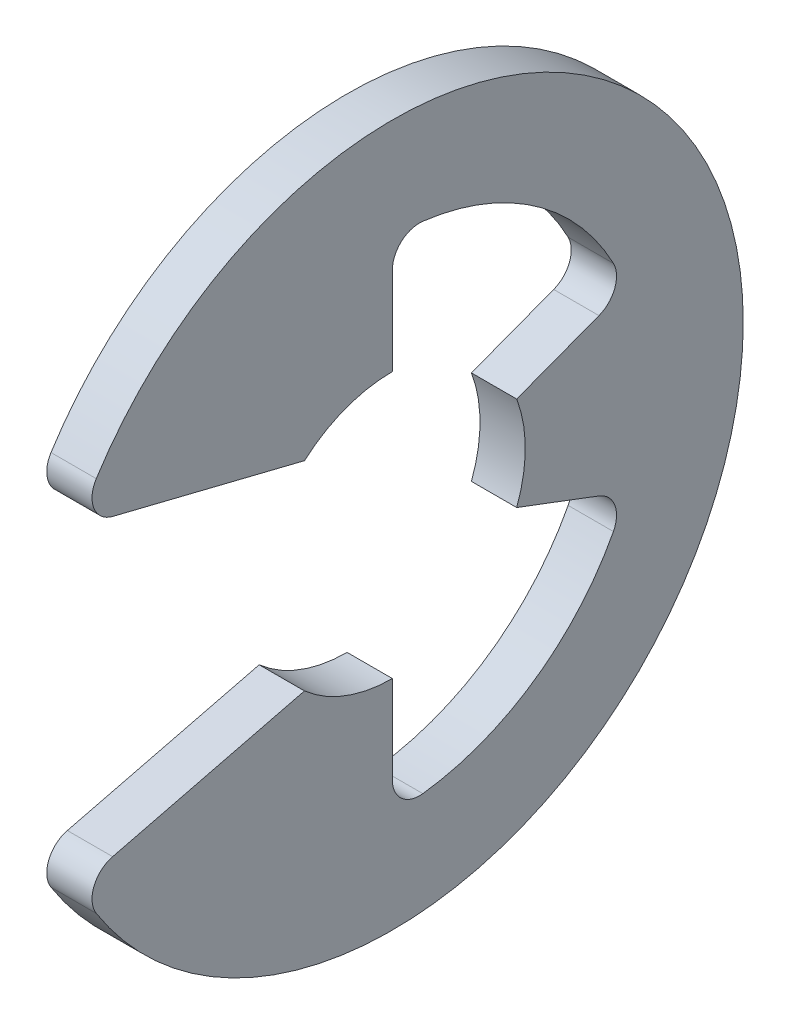
ISO-10303-21;
HEADER;
FILE_DESCRIPTION(('STEP AP214'),'2;1');
FILE_NAME('part.step','',(''),(''),'','','');
FILE_SCHEMA(('AUTOMOTIVE_DESIGN { 1 0 10303 214 1 1 1 1 }'));
ENDSEC;
DATA;
#1=APPLICATION_CONTEXT('core data for automotive mechanical design processes');
#2=APPLICATION_PROTOCOL_DEFINITION('international standard','automotive_design',2000,#1);
#3=PRODUCT_CONTEXT('',#1,'mechanical');
#4=PRODUCT('Part','Part','',(#3));
#5=PRODUCT_RELATED_PRODUCT_CATEGORY('part','',(#4));
#6=PRODUCT_DEFINITION_FORMATION('','',#4);
#7=PRODUCT_DEFINITION_CONTEXT('part definition',#1,'design');
#8=PRODUCT_DEFINITION('design','',#6,#7);
#9=PRODUCT_DEFINITION_SHAPE('','',#8);
#10=(LENGTH_UNIT() NAMED_UNIT(*) SI_UNIT(.MILLI.,.METRE.));
#11=(NAMED_UNIT(*) PLANE_ANGLE_UNIT() SI_UNIT($,.RADIAN.));
#12=(NAMED_UNIT(*) SI_UNIT($,.STERADIAN.) SOLID_ANGLE_UNIT());
#13=UNCERTAINTY_MEASURE_WITH_UNIT(LENGTH_MEASURE(1.E-05),#10,'distance_accuracy_value','');
#14=(GEOMETRIC_REPRESENTATION_CONTEXT(3) GLOBAL_UNCERTAINTY_ASSIGNED_CONTEXT((#13)) GLOBAL_UNIT_ASSIGNED_CONTEXT((#10,
#11,#12)) REPRESENTATION_CONTEXT('',''));
#15=CARTESIAN_POINT('',(0.,0.,0.));
#16=DIRECTION('',(0.,0.,1.));
#17=DIRECTION('',(1.,0.,0.));
#18=AXIS2_PLACEMENT_3D('',#15,#16,#17);
#19=CARTESIAN_POINT('',(0.35,0.,0.));
#20=DIRECTION('',(-1.,0.,0.));
#21=DIRECTION('',(0.,0.,1.));
#22=AXIS2_PLACEMENT_3D('',#19,#20,#21);
#23=CYLINDRICAL_SURFACE('',#22,5.425);
#24=CARTESIAN_POINT('',(0.35,0.,0.));
#25=DIRECTION('',(1.,0.,0.));
#26=DIRECTION('',(0.,0.,-1.));
#27=AXIS2_PLACEMENT_3D('',#24,#25,#26);
#28=CIRCLE('',#27,5.425);
#29=CARTESIAN_POINT('',(0.35,-2.91048609757391,4.57817602062535));
#30=VERTEX_POINT('',#29);
#31=CARTESIAN_POINT('',(0.35,2.91048609757391,4.57817602062535));
#32=VERTEX_POINT('',#31);
#33=EDGE_CURVE('E172',#30,#32,#28,.T.);
#34=ORIENTED_EDGE('',*,*,#33,.F.);
#35=DIRECTION('',(-1.,0.,0.));
#36=VECTOR('',#35,1.);
#37=CARTESIAN_POINT('',(0.35,-2.91048609757391,4.57817602062535));
#38=LINE('',#37,#36);
#39=CARTESIAN_POINT('',(-0.35,-2.91048609757391,4.57817602062535));
#40=VERTEX_POINT('',#39);
#41=EDGE_CURVE('E266',#30,#40,#38,.T.);
#42=ORIENTED_EDGE('',*,*,#41,.T.);
#43=CARTESIAN_POINT('',(-0.35,0.,0.));
#44=DIRECTION('',(1.,0.,0.));
#45=DIRECTION('',(0.,0.,-1.));
#46=AXIS2_PLACEMENT_3D('',#43,#44,#45);
#47=CIRCLE('',#46,5.425);
#48=CARTESIAN_POINT('',(-0.35,2.91048609757391,4.57817602062535));
#49=VERTEX_POINT('',#48);
#50=EDGE_CURVE('E210',#40,#49,#47,.T.);
#51=ORIENTED_EDGE('',*,*,#50,.T.);
#52=DIRECTION('',(-1.,0.,0.));
#53=VECTOR('',#52,1.);
#54=CARTESIAN_POINT('',(0.35,2.91048609757391,4.57817602062535));
#55=LINE('',#54,#53);
#56=EDGE_CURVE('E264',#49,#32,#55,.F.);
#57=ORIENTED_EDGE('',*,*,#56,.T.);
#58=EDGE_LOOP('',(#34,#42,#51,#57));
#59=FACE_BOUND('',#58,.T.);
#60=ADVANCED_FACE('F34',(#59),#23,.T.);
#61=CARTESIAN_POINT('',(0.35,2.41039731260291,4.86010388730495));
#62=DIRECTION('',(0.,0.970536829925373,-0.240952820606874));
#63=DIRECTION('',(0.,0.240952820606874,0.970536829925373));
#64=AXIS2_PLACEMENT_3D('',#61,#62,#63);
#65=PLANE('',#64);
#66=DIRECTION('',(0.,-0.240952820606874,-0.970536829925373));
#67=VECTOR('',#66,1.);
#68=CARTESIAN_POINT('',(0.35,2.41039731260291,4.86010388730495));
#69=LINE('',#68,#67);
#70=CARTESIAN_POINT('',(0.35,2.27753267306405,4.32493677142537));
#71=VERTEX_POINT('',#70);
#72=CARTESIAN_POINT('',(0.35,1.54125,1.35925473605943));
#73=VERTEX_POINT('',#72);
#74=EDGE_CURVE('E158',#71,#73,#69,.T.);
#75=ORIENTED_EDGE('',*,*,#74,.F.);
#76=DIRECTION('',(-1.,0.,0.));
#77=VECTOR('',#76,1.);
#78=CARTESIAN_POINT('',(0.35,2.27753267306405,4.32493677142537));
#79=LINE('',#78,#77);
#80=CARTESIAN_POINT('',(-0.35,2.27753267306405,4.32493677142537));
#81=VERTEX_POINT('',#80);
#82=EDGE_CURVE('E278',#71,#81,#79,.T.);
#83=ORIENTED_EDGE('',*,*,#82,.T.);
#84=DIRECTION('',(0.,-0.240952820606874,-0.970536829925373));
#85=VECTOR('',#84,1.);
#86=CARTESIAN_POINT('',(-0.35,2.41039731260291,4.86010388730495));
#87=LINE('',#86,#85);
#88=CARTESIAN_POINT('',(-0.35,1.54125,1.35925473605943));
#89=VERTEX_POINT('',#88);
#90=EDGE_CURVE('E178',#81,#89,#87,.T.);
#91=ORIENTED_EDGE('',*,*,#90,.T.);
#92=DIRECTION('',(-1.,0.,0.));
#93=VECTOR('',#92,1.);
#94=CARTESIAN_POINT('',(0.35,1.54125,1.35925473605943));
#95=LINE('',#94,#93);
#96=EDGE_CURVE('E175',#73,#89,#95,.T.);
#97=ORIENTED_EDGE('',*,*,#96,.F.);
#98=EDGE_LOOP('',(#75,#83,#91,#97));
#99=FACE_BOUND('',#98,.T.);
#100=ADVANCED_FACE('F176',(#99),#65,.F.);
#101=CARTESIAN_POINT('',(0.35,0.,0.));
#102=DIRECTION('',(-1.,0.,0.));
#103=DIRECTION('',(0.,0.,1.));
#104=AXIS2_PLACEMENT_3D('',#101,#102,#103);
#105=CYLINDRICAL_SURFACE('',#104,2.055);
#106=CARTESIAN_POINT('',(-0.35,0.,0.));
#107=DIRECTION('',(-1.,0.,0.));
#108=DIRECTION('',(0.,0.,1.));
#109=AXIS2_PLACEMENT_3D('',#106,#107,#108);
#110=CIRCLE('',#109,2.055);
#111=CARTESIAN_POINT('',(-0.35,2.055,0.));
#112=VERTEX_POINT('',#111);
#113=EDGE_CURVE('E214',#89,#112,#110,.T.);
#114=ORIENTED_EDGE('',*,*,#113,.T.);
#115=DIRECTION('',(-1.,0.,0.));
#116=VECTOR('',#115,1.);
#117=CARTESIAN_POINT('',(0.35,2.055,0.));
#118=LINE('',#117,#116);
#119=CARTESIAN_POINT('',(0.35,2.055,0.));
#120=VERTEX_POINT('',#119);
#121=EDGE_CURVE('E182',#120,#112,#118,.T.);
#122=ORIENTED_EDGE('',*,*,#121,.F.);
#123=CARTESIAN_POINT('',(0.35,0.,0.));
#124=DIRECTION('',(-1.,0.,0.));
#125=DIRECTION('',(0.,0.,1.));
#126=AXIS2_PLACEMENT_3D('',#123,#124,#125);
#127=CIRCLE('',#126,2.055);
#128=EDGE_CURVE('E164',#73,#120,#127,.T.);
#129=ORIENTED_EDGE('',*,*,#128,.F.);
#130=ORIENTED_EDGE('',*,*,#96,.T.);
#131=EDGE_LOOP('',(#114,#122,#129,#130));
#132=FACE_BOUND('',#131,.T.);
#133=ADVANCED_FACE('F184',(#132),#105,.F.);
#134=CARTESIAN_POINT('',(0.35,2.055,0.));
#135=DIRECTION('',(0.,0.,1.));
#136=DIRECTION('',(0.,-1.,0.));
#137=AXIS2_PLACEMENT_3D('',#134,#135,#136);
#138=PLANE('',#137);
#139=DIRECTION('',(0.,1.,0.));
#140=VECTOR('',#139,1.);
#141=CARTESIAN_POINT('',(-0.35,2.055,0.));
#142=LINE('',#141,#140);
#143=CARTESIAN_POINT('',(-0.35,3.41491421940735,0.));
#144=VERTEX_POINT('',#143);
#145=EDGE_CURVE('E216',#112,#144,#142,.T.);
#146=ORIENTED_EDGE('',*,*,#145,.T.);
#147=DIRECTION('',(1.,0.,0.));
#148=VECTOR('',#147,1.);
#149=CARTESIAN_POINT('',(0.35,3.41491421940735,0.));
#150=LINE('',#149,#148);
#151=CARTESIAN_POINT('',(0.35,3.41491421940735,0.));
#152=VERTEX_POINT('',#151);
#153=EDGE_CURVE('E262',#144,#152,#150,.T.);
#154=ORIENTED_EDGE('',*,*,#153,.T.);
#155=DIRECTION('',(0.,1.,0.));
#156=VECTOR('',#155,1.);
#157=CARTESIAN_POINT('',(0.35,2.055,0.));
#158=LINE('',#157,#156);
#159=EDGE_CURVE('E187',#120,#152,#158,.T.);
#160=ORIENTED_EDGE('',*,*,#159,.F.);
#161=ORIENTED_EDGE('',*,*,#121,.T.);
#162=EDGE_LOOP('',(#146,#154,#160,#161));
#163=FACE_BOUND('',#162,.T.);
#164=ADVANCED_FACE('F384',(#163),#138,.F.);
#165=CARTESIAN_POINT('',(0.35,0.,0.));
#166=DIRECTION('',(-1.,0.,0.));
#167=DIRECTION('',(0.,0.,1.));
#168=AXIS2_PLACEMENT_3D('',#165,#166,#167);
#169=CYLINDRICAL_SURFACE('',#168,3.86064516129032);
#170=CARTESIAN_POINT('',(0.35,0.,0.));
#171=DIRECTION('',(-1.,0.,0.));
#172=DIRECTION('',(0.,0.,-1.));
#173=AXIS2_PLACEMENT_3D('',#170,#171,#172);
#174=CIRCLE('',#173,3.86064516129032);
#175=CARTESIAN_POINT('',(0.35,3.83177324000255,-0.471269454340894));
#176=VERTEX_POINT('',#175);
#177=CARTESIAN_POINT('',(0.35,1.79556862973636,-3.4176767485093));
#178=VERTEX_POINT('',#177);
#179=EDGE_CURVE('E189',#176,#178,#174,.T.);
#180=ORIENTED_EDGE('',*,*,#179,.F.);
#181=DIRECTION('',(-1.,0.,0.));
#182=VECTOR('',#181,1.);
#183=CARTESIAN_POINT('',(0.35,3.83177324000255,-0.471269454340894));
#184=LINE('',#183,#182);
#185=CARTESIAN_POINT('',(-0.35,3.83177324000255,-0.471269454340894));
#186=VERTEX_POINT('',#185);
#187=EDGE_CURVE('E259',#176,#186,#184,.T.);
#188=ORIENTED_EDGE('',*,*,#187,.T.);
#189=CARTESIAN_POINT('',(-0.35,0.,0.));
#190=DIRECTION('',(-1.,0.,0.));
#191=DIRECTION('',(0.,0.,-1.));
#192=AXIS2_PLACEMENT_3D('',#189,#190,#191);
#193=CIRCLE('',#192,3.86064516129032);
#194=CARTESIAN_POINT('',(-0.35,1.79556862973636,-3.4176767485093));
#195=VERTEX_POINT('',#194);
#196=EDGE_CURVE('E219',#186,#195,#193,.T.);
#197=ORIENTED_EDGE('',*,*,#196,.T.);
#198=DIRECTION('',(-1.,0.,0.));
#199=VECTOR('',#198,1.);
#200=CARTESIAN_POINT('',(0.35,1.79556862973636,-3.4176767485093));
#201=LINE('',#200,#199);
#202=EDGE_CURVE('E257',#195,#178,#201,.F.);
#203=ORIENTED_EDGE('',*,*,#202,.T.);
#204=EDGE_LOOP('',(#180,#188,#197,#203));
#205=FACE_BOUND('',#204,.T.);
#206=ADVANCED_FACE('F306',(#205),#169,.F.);
#207=CARTESIAN_POINT('',(0.35,0.726552217669176,-1.92227648245511));
#208=DIRECTION('',(0.,-0.935414346693485,-0.353553390593275));
#209=DIRECTION('',(0.,0.353553390593275,-0.935414346693485));
#210=AXIS2_PLACEMENT_3D('',#207,#208,#209);
#211=PLANE('',#210);
#212=DIRECTION('',(0.,-0.353553390593275,0.935414346693485));
#213=VECTOR('',#212,1.);
#214=CARTESIAN_POINT('',(0.35,0.726552217669176,-1.92227648245511));
#215=LINE('',#214,#213);
#216=CARTESIAN_POINT('',(0.35,1.20735450085665,-3.19435975356122));
#217=VERTEX_POINT('',#216);
#218=CARTESIAN_POINT('',(0.35,0.726552217669177,-1.92227648245511));
#219=VERTEX_POINT('',#218);
#220=EDGE_CURVE('E194',#217,#219,#215,.T.);
#221=ORIENTED_EDGE('',*,*,#220,.F.);
#222=DIRECTION('',(1.,0.,0.));
#223=VECTOR('',#222,1.);
#224=CARTESIAN_POINT('',(-0.35,1.20735450085665,-3.19435975356122));
#225=LINE('',#224,#223);
#226=CARTESIAN_POINT('',(-0.35,1.20735450085665,-3.19435975356122));
#227=VERTEX_POINT('',#226);
#228=EDGE_CURVE('E281',#217,#227,#225,.F.);
#229=ORIENTED_EDGE('',*,*,#228,.T.);
#230=DIRECTION('',(0.,-0.353553390593275,0.935414346693485));
#231=VECTOR('',#230,1.);
#232=CARTESIAN_POINT('',(-0.35,0.726552217669176,-1.92227648245511));
#233=LINE('',#232,#231);
#234=CARTESIAN_POINT('',(-0.35,0.726552217669177,-1.92227648245511));
#235=VERTEX_POINT('',#234);
#236=EDGE_CURVE('E222',#227,#235,#233,.T.);
#237=ORIENTED_EDGE('',*,*,#236,.T.);
#238=DIRECTION('',(-1.,0.,0.));
#239=VECTOR('',#238,1.);
#240=CARTESIAN_POINT('',(0.35,0.726552217669177,-1.92227648245511));
#241=LINE('',#240,#239);
#242=EDGE_CURVE('E246',#219,#235,#241,.T.);
#243=ORIENTED_EDGE('',*,*,#242,.F.);
#244=EDGE_LOOP('',(#221,#229,#237,#243));
#245=FACE_BOUND('',#244,.T.);
#246=ADVANCED_FACE('F309',(#245),#211,.F.);
#247=CARTESIAN_POINT('',(0.35,0.,0.));
#248=DIRECTION('',(-1.,0.,0.));
#249=DIRECTION('',(0.,0.,1.));
#250=AXIS2_PLACEMENT_3D('',#247,#248,#249);
#251=CYLINDRICAL_SURFACE('',#250,2.055);
#252=CARTESIAN_POINT('',(-0.35,0.,0.));
#253=DIRECTION('',(-1.,0.,0.));
#254=DIRECTION('',(0.,0.,1.));
#255=AXIS2_PLACEMENT_3D('',#252,#253,#254);
#256=CIRCLE('',#255,2.055);
#257=CARTESIAN_POINT('',(-0.35,-0.726552217669176,-1.92227648245511));
#258=VERTEX_POINT('',#257);
#259=EDGE_CURVE('E224',#235,#258,#256,.T.);
#260=ORIENTED_EDGE('',*,*,#259,.T.);
#261=DIRECTION('',(-1.,0.,0.));
#262=VECTOR('',#261,1.);
#263=CARTESIAN_POINT('',(0.35,-0.726552217669176,-1.92227648245511));
#264=LINE('',#263,#262);
#265=CARTESIAN_POINT('',(0.35,-0.726552217669176,-1.92227648245511));
#266=VERTEX_POINT('',#265);
#267=EDGE_CURVE('E243',#266,#258,#264,.T.);
#268=ORIENTED_EDGE('',*,*,#267,.F.);
#269=CARTESIAN_POINT('',(0.35,0.,0.));
#270=DIRECTION('',(-1.,0.,0.));
#271=DIRECTION('',(0.,0.,1.));
#272=AXIS2_PLACEMENT_3D('',#269,#270,#271);
#273=CIRCLE('',#272,2.055);
#274=EDGE_CURVE('E196',#219,#266,#273,.T.);
#275=ORIENTED_EDGE('',*,*,#274,.F.);
#276=ORIENTED_EDGE('',*,*,#242,.T.);
#277=EDGE_LOOP('',(#260,#268,#275,#276));
#278=FACE_BOUND('',#277,.T.);
#279=ADVANCED_FACE('F315',(#278),#251,.F.);
#280=CARTESIAN_POINT('',(0.35,-0.726552217669176,-1.92227648245511));
#281=DIRECTION('',(0.,0.935414346693485,-0.353553390593275));
#282=DIRECTION('',(0.,0.353553390593275,0.935414346693485));
#283=AXIS2_PLACEMENT_3D('',#280,#281,#282);
#284=PLANE('',#283);
#285=DIRECTION('',(0.,-0.353553390593275,-0.935414346693485));
#286=VECTOR('',#285,1.);
#287=CARTESIAN_POINT('',(-0.35,-0.726552217669176,-1.92227648245511));
#288=LINE('',#287,#286);
#289=CARTESIAN_POINT('',(-0.35,-1.20735450085665,-3.19435975356122));
#290=VERTEX_POINT('',#289);
#291=EDGE_CURVE('E226',#258,#290,#288,.T.);
#292=ORIENTED_EDGE('',*,*,#291,.T.);
#293=DIRECTION('',(1.,0.,0.));
#294=VECTOR('',#293,1.);
#295=CARTESIAN_POINT('',(0.35,-1.20735450085665,-3.19435975356122));
#296=LINE('',#295,#294);
#297=CARTESIAN_POINT('',(0.35,-1.20735450085665,-3.19435975356122));
#298=VERTEX_POINT('',#297);
#299=EDGE_CURVE('E49',#290,#298,#296,.T.);
#300=ORIENTED_EDGE('',*,*,#299,.T.);
#301=DIRECTION('',(0.,-0.353553390593275,-0.935414346693485));
#302=VECTOR('',#301,1.);
#303=CARTESIAN_POINT('',(0.35,-0.726552217669176,-1.92227648245511));
#304=LINE('',#303,#302);
#305=EDGE_CURVE('E198',#266,#298,#304,.T.);
#306=ORIENTED_EDGE('',*,*,#305,.F.);
#307=ORIENTED_EDGE('',*,*,#267,.T.);
#308=EDGE_LOOP('',(#292,#300,#306,#307));
#309=FACE_BOUND('',#308,.T.);
#310=ADVANCED_FACE('F317',(#309),#284,.F.);
#311=CARTESIAN_POINT('',(0.35,0.,0.));
#312=DIRECTION('',(-1.,0.,0.));
#313=DIRECTION('',(0.,0.,1.));
#314=AXIS2_PLACEMENT_3D('',#311,#312,#313);
#315=CYLINDRICAL_SURFACE('',#314,3.86064516129032);
#316=CARTESIAN_POINT('',(-0.35,0.,0.));
#317=DIRECTION('',(-1.,0.,0.));
#318=DIRECTION('',(0.,0.,-1.));
#319=AXIS2_PLACEMENT_3D('',#316,#317,#318);
#320=CIRCLE('',#319,3.86064516129032);
#321=CARTESIAN_POINT('',(-0.35,-1.79556862973636,-3.4176767485093));
#322=VERTEX_POINT('',#321);
#323=CARTESIAN_POINT('',(-0.35,-3.83177324000255,-0.471269454340895));
#324=VERTEX_POINT('',#323);
#325=EDGE_CURVE('E228',#322,#324,#320,.T.);
#326=ORIENTED_EDGE('',*,*,#325,.T.);
#327=DIRECTION('',(-1.,0.,0.));
#328=VECTOR('',#327,1.);
#329=CARTESIAN_POINT('',(0.35,-3.83177324000255,-0.471269454340895));
#330=LINE('',#329,#328);
#331=CARTESIAN_POINT('',(0.35,-3.83177324000255,-0.471269454340895));
#332=VERTEX_POINT('',#331);
#333=EDGE_CURVE('E255',#324,#332,#330,.F.);
#334=ORIENTED_EDGE('',*,*,#333,.T.);
#335=CARTESIAN_POINT('',(0.35,0.,0.));
#336=DIRECTION('',(-1.,0.,0.));
#337=DIRECTION('',(0.,0.,-1.));
#338=AXIS2_PLACEMENT_3D('',#335,#336,#337);
#339=CIRCLE('',#338,3.86064516129032);
#340=CARTESIAN_POINT('',(0.35,-1.79556862973636,-3.4176767485093));
#341=VERTEX_POINT('',#340);
#342=EDGE_CURVE('E200',#341,#332,#339,.T.);
#343=ORIENTED_EDGE('',*,*,#342,.F.);
#344=DIRECTION('',(-1.,0.,0.));
#345=VECTOR('',#344,1.);
#346=CARTESIAN_POINT('',(0.35,-1.79556862973636,-3.4176767485093));
#347=LINE('',#346,#345);
#348=EDGE_CURVE('E252',#341,#322,#347,.T.);
#349=ORIENTED_EDGE('',*,*,#348,.T.);
#350=EDGE_LOOP('',(#326,#334,#343,#349));
#351=FACE_BOUND('',#350,.T.);
#352=ADVANCED_FACE('F319',(#351),#315,.F.);
#353=CARTESIAN_POINT('',(0.35,-2.055,0.));
#354=DIRECTION('',(0.,0.,1.));
#355=DIRECTION('',(0.,-1.,0.));
#356=AXIS2_PLACEMENT_3D('',#353,#354,#355);
#357=PLANE('',#356);
#358=DIRECTION('',(0.,1.,0.));
#359=VECTOR('',#358,1.);
#360=CARTESIAN_POINT('',(0.35,-2.055,0.));
#361=LINE('',#360,#359);
#362=CARTESIAN_POINT('',(0.35,-3.41491421940735,0.));
#363=VERTEX_POINT('',#362);
#364=CARTESIAN_POINT('',(0.35,-2.055,0.));
#365=VERTEX_POINT('',#364);
#366=EDGE_CURVE('E203',#363,#365,#361,.T.);
#367=ORIENTED_EDGE('',*,*,#366,.F.);
#368=DIRECTION('',(1.,0.,0.));
#369=VECTOR('',#368,1.);
#370=CARTESIAN_POINT('',(-0.35,-3.41491421940735,0.));
#371=LINE('',#370,#369);
#372=CARTESIAN_POINT('',(-0.35,-3.41491421940735,0.));
#373=VERTEX_POINT('',#372);
#374=EDGE_CURVE('E181',#363,#373,#371,.F.);
#375=ORIENTED_EDGE('',*,*,#374,.T.);
#376=DIRECTION('',(0.,1.,0.));
#377=VECTOR('',#376,1.);
#378=CARTESIAN_POINT('',(-0.35,-2.055,0.));
#379=LINE('',#378,#377);
#380=CARTESIAN_POINT('',(-0.35,-2.055,0.));
#381=VERTEX_POINT('',#380);
#382=EDGE_CURVE('E231',#373,#381,#379,.T.);
#383=ORIENTED_EDGE('',*,*,#382,.T.);
#384=DIRECTION('',(-1.,0.,0.));
#385=VECTOR('',#384,1.);
#386=CARTESIAN_POINT('',(0.35,-2.055,0.));
#387=LINE('',#386,#385);
#388=EDGE_CURVE('E240',#365,#381,#387,.T.);
#389=ORIENTED_EDGE('',*,*,#388,.F.);
#390=EDGE_LOOP('',(#367,#375,#383,#389));
#391=FACE_BOUND('',#390,.T.);
#392=ADVANCED_FACE('F325',(#391),#357,.F.);
#393=CARTESIAN_POINT('',(0.35,0.,0.));
#394=DIRECTION('',(-1.,0.,0.));
#395=DIRECTION('',(0.,0.,1.));
#396=AXIS2_PLACEMENT_3D('',#393,#394,#395);
#397=CYLINDRICAL_SURFACE('',#396,2.055);
#398=CARTESIAN_POINT('',(-0.35,0.,0.));
#399=DIRECTION('',(-1.,0.,0.));
#400=DIRECTION('',(0.,0.,-1.));
#401=AXIS2_PLACEMENT_3D('',#398,#399,#400);
#402=CIRCLE('',#401,2.055);
#403=CARTESIAN_POINT('',(-0.35,-1.54125,1.35925473605943));
#404=VERTEX_POINT('',#403);
#405=EDGE_CURVE('E233',#381,#404,#402,.T.);
#406=ORIENTED_EDGE('',*,*,#405,.T.);
#407=DIRECTION('',(-1.,0.,0.));
#408=VECTOR('',#407,1.);
#409=CARTESIAN_POINT('',(0.35,-1.54125,1.35925473605943));
#410=LINE('',#409,#408);
#411=CARTESIAN_POINT('',(0.35,-1.54125,1.35925473605943));
#412=VERTEX_POINT('',#411);
#413=EDGE_CURVE('E209',#412,#404,#410,.T.);
#414=ORIENTED_EDGE('',*,*,#413,.F.);
#415=CARTESIAN_POINT('',(0.35,0.,0.));
#416=DIRECTION('',(-1.,0.,0.));
#417=DIRECTION('',(0.,0.,-1.));
#418=AXIS2_PLACEMENT_3D('',#415,#416,#417);
#419=CIRCLE('',#418,2.055);
#420=EDGE_CURVE('E205',#365,#412,#419,.T.);
#421=ORIENTED_EDGE('',*,*,#420,.F.);
#422=ORIENTED_EDGE('',*,*,#388,.T.);
#423=EDGE_LOOP('',(#406,#414,#421,#422));
#424=FACE_BOUND('',#423,.T.);
#425=ADVANCED_FACE('F374',(#424),#397,.F.);
#426=CARTESIAN_POINT('',(0.35,-2.41039731260291,4.86010388730495));
#427=DIRECTION('',(0.,-0.970536829925373,-0.240952820606874));
#428=DIRECTION('',(0.,0.240952820606874,-0.970536829925373));
#429=AXIS2_PLACEMENT_3D('',#426,#427,#428);
#430=PLANE('',#429);
#431=DIRECTION('',(0.,-0.240952820606874,0.970536829925373));
#432=VECTOR('',#431,1.);
#433=CARTESIAN_POINT('',(-0.35,-2.41039731260291,4.86010388730495));
#434=LINE('',#433,#432);
#435=CARTESIAN_POINT('',(-0.35,-2.27753267306405,4.32493677142537));
#436=VERTEX_POINT('',#435);
#437=EDGE_CURVE('E235',#404,#436,#434,.T.);
#438=ORIENTED_EDGE('',*,*,#437,.T.);
#439=DIRECTION('',(-1.,0.,0.));
#440=VECTOR('',#439,1.);
#441=CARTESIAN_POINT('',(0.35,-2.27753267306405,4.32493677142537));
#442=LINE('',#441,#440);
#443=CARTESIAN_POINT('',(0.35,-2.27753267306405,4.32493677142537));
#444=VERTEX_POINT('',#443);
#445=EDGE_CURVE('E273',#436,#444,#442,.F.);
#446=ORIENTED_EDGE('',*,*,#445,.T.);
#447=DIRECTION('',(0.,-0.240952820606874,0.970536829925373));
#448=VECTOR('',#447,1.);
#449=CARTESIAN_POINT('',(0.35,-2.41039731260291,4.86010388730495));
#450=LINE('',#449,#448);
#451=EDGE_CURVE('E207',#412,#444,#450,.T.);
#452=ORIENTED_EDGE('',*,*,#451,.F.);
#453=ORIENTED_EDGE('',*,*,#413,.T.);
#454=EDGE_LOOP('',(#438,#446,#452,#453));
#455=FACE_BOUND('',#454,.T.);
#456=ADVANCED_FACE('F416',(#455),#430,.F.);
#457=CARTESIAN_POINT('',(0.35,0.,0.));
#458=DIRECTION('',(1.,0.,0.));
#459=DIRECTION('',(0.,0.,-1.));
#460=AXIS2_PLACEMENT_3D('',#457,#458,#459);
#461=PLANE('',#460);
#462=ORIENTED_EDGE('',*,*,#451,.T.);
#463=CARTESIAN_POINT('',(0.35,-2.6851581416327,4.22373658677049));
#464=DIRECTION('',(1.,0.,0.));
#465=DIRECTION('',(0.,0.,-1.));
#466=AXIS2_PLACEMENT_3D('',#463,#464,#465);
#467=CIRCLE('',#466,0.42);
#468=EDGE_CURVE('E276',#444,#30,#467,.T.);
#469=ORIENTED_EDGE('',*,*,#468,.T.);
#470=ORIENTED_EDGE('',*,*,#33,.T.);
#471=CARTESIAN_POINT('',(0.35,2.6851581416327,4.22373658677049));
#472=DIRECTION('',(1.,0.,0.));
#473=DIRECTION('',(0.,0.,-1.));
#474=AXIS2_PLACEMENT_3D('',#471,#472,#473);
#475=CIRCLE('',#474,0.42);
#476=EDGE_CURVE('E168',#32,#71,#475,.T.);
#477=ORIENTED_EDGE('',*,*,#476,.T.);
#478=ORIENTED_EDGE('',*,*,#74,.T.);
#479=ORIENTED_EDGE('',*,*,#128,.T.);
#480=ORIENTED_EDGE('',*,*,#159,.T.);
#481=CARTESIAN_POINT('',(0.35,3.41491421940735,-0.419999999999998));
#482=DIRECTION('',(1.,0.,0.));
#483=DIRECTION('',(0.,0.,-1.));
#484=AXIS2_PLACEMENT_3D('',#481,#482,#483);
#485=CIRCLE('',#484,0.42);
#486=EDGE_CURVE('E290',#152,#176,#485,.F.);
#487=ORIENTED_EDGE('',*,*,#486,.T.);
#488=ORIENTED_EDGE('',*,*,#179,.T.);
#489=CARTESIAN_POINT('',(0.35,1.60022852646792,-3.04586732951205));
#490=DIRECTION('',(1.,0.,0.));
#491=DIRECTION('',(0.,0.,-1.));
#492=AXIS2_PLACEMENT_3D('',#489,#490,#491);
#493=CIRCLE('',#492,0.42);
#494=EDGE_CURVE('E11',#178,#217,#493,.F.);
#495=ORIENTED_EDGE('',*,*,#494,.T.);
#496=ORIENTED_EDGE('',*,*,#220,.T.);
#497=ORIENTED_EDGE('',*,*,#274,.T.);
#498=ORIENTED_EDGE('',*,*,#305,.T.);
#499=CARTESIAN_POINT('',(0.35,-1.60022852646792,-3.04586732951205));
#500=DIRECTION('',(1.,0.,0.));
#501=DIRECTION('',(0.,0.,-1.));
#502=AXIS2_PLACEMENT_3D('',#499,#500,#501);
#503=CIRCLE('',#502,0.42);
#504=EDGE_CURVE('E294',#298,#341,#503,.F.);
#505=ORIENTED_EDGE('',*,*,#504,.T.);
#506=ORIENTED_EDGE('',*,*,#342,.T.);
#507=CARTESIAN_POINT('',(0.35,-3.41491421940735,-0.419999999999999));
#508=DIRECTION('',(1.,0.,0.));
#509=DIRECTION('',(0.,0.,-1.));
#510=AXIS2_PLACEMENT_3D('',#507,#508,#509);
#511=CIRCLE('',#510,0.42);
#512=EDGE_CURVE('E286',#332,#363,#511,.F.);
#513=ORIENTED_EDGE('',*,*,#512,.T.);
#514=ORIENTED_EDGE('',*,*,#366,.T.);
#515=ORIENTED_EDGE('',*,*,#420,.T.);
#516=EDGE_LOOP('',(#462,#469,#470,#477,#478,#479,#480,#487,#488,#495,#496,#497,#498,#505,#506,
#513,#514,#515));
#517=FACE_BOUND('',#516,.T.);
#518=ADVANCED_FACE('F161',(#517),#461,.T.);
#519=CARTESIAN_POINT('',(-0.35,0.,0.));
#520=DIRECTION('',(1.,0.,0.));
#521=DIRECTION('',(0.,0.,-1.));
#522=AXIS2_PLACEMENT_3D('',#519,#520,#521);
#523=PLANE('',#522);
#524=ORIENTED_EDGE('',*,*,#50,.F.);
#525=CARTESIAN_POINT('',(-0.35,-2.6851581416327,4.22373658677049));
#526=DIRECTION('',(1.,0.,0.));
#527=DIRECTION('',(0.,0.,-1.));
#528=AXIS2_PLACEMENT_3D('',#525,#526,#527);
#529=CIRCLE('',#528,0.42);
#530=EDGE_CURVE('E271',#40,#436,#529,.F.);
#531=ORIENTED_EDGE('',*,*,#530,.T.);
#532=ORIENTED_EDGE('',*,*,#437,.F.);
#533=ORIENTED_EDGE('',*,*,#405,.F.);
#534=ORIENTED_EDGE('',*,*,#382,.F.);
#535=CARTESIAN_POINT('',(-0.35,-3.41491421940735,-0.419999999999999));
#536=DIRECTION('',(1.,0.,0.));
#537=DIRECTION('',(0.,0.,-1.));
#538=AXIS2_PLACEMENT_3D('',#535,#536,#537);
#539=CIRCLE('',#538,0.42);
#540=EDGE_CURVE('E284',#373,#324,#539,.T.);
#541=ORIENTED_EDGE('',*,*,#540,.T.);
#542=ORIENTED_EDGE('',*,*,#325,.F.);
#543=CARTESIAN_POINT('',(-0.35,-1.60022852646792,-3.04586732951205));
#544=DIRECTION('',(1.,0.,0.));
#545=DIRECTION('',(0.,0.,-1.));
#546=AXIS2_PLACEMENT_3D('',#543,#544,#545);
#547=CIRCLE('',#546,0.42);
#548=EDGE_CURVE('E292',#322,#290,#547,.T.);
#549=ORIENTED_EDGE('',*,*,#548,.T.);
#550=ORIENTED_EDGE('',*,*,#291,.F.);
#551=ORIENTED_EDGE('',*,*,#259,.F.);
#552=ORIENTED_EDGE('',*,*,#236,.F.);
#553=CARTESIAN_POINT('',(-0.35,1.60022852646792,-3.04586732951205));
#554=DIRECTION('',(1.,0.,0.));
#555=DIRECTION('',(0.,0.,-1.));
#556=AXIS2_PLACEMENT_3D('',#553,#554,#555);
#557=CIRCLE('',#556,0.42);
#558=EDGE_CURVE('E42',#227,#195,#557,.T.);
#559=ORIENTED_EDGE('',*,*,#558,.T.);
#560=ORIENTED_EDGE('',*,*,#196,.F.);
#561=CARTESIAN_POINT('',(-0.35,3.41491421940735,-0.419999999999998));
#562=DIRECTION('',(1.,0.,0.));
#563=DIRECTION('',(0.,0.,-1.));
#564=AXIS2_PLACEMENT_3D('',#561,#562,#563);
#565=CIRCLE('',#564,0.42);
#566=EDGE_CURVE('E288',#186,#144,#565,.T.);
#567=ORIENTED_EDGE('',*,*,#566,.T.);
#568=ORIENTED_EDGE('',*,*,#145,.F.);
#569=ORIENTED_EDGE('',*,*,#113,.F.);
#570=ORIENTED_EDGE('',*,*,#90,.F.);
#571=CARTESIAN_POINT('',(-0.35,2.6851581416327,4.22373658677049));
#572=DIRECTION('',(1.,0.,0.));
#573=DIRECTION('',(0.,0.,-1.));
#574=AXIS2_PLACEMENT_3D('',#571,#572,#573);
#575=CIRCLE('',#574,0.42);
#576=EDGE_CURVE('E269',#81,#49,#575,.F.);
#577=ORIENTED_EDGE('',*,*,#576,.T.);
#578=EDGE_LOOP('',(#524,#531,#532,#533,#534,#541,#542,#549,#550,#551,#552,#559,#560,#567,#568,
#569,#570,#577));
#579=FACE_BOUND('',#578,.T.);
#580=ADVANCED_FACE('F299',(#579),#523,.F.);
#581=CARTESIAN_POINT('',(0.35,-3.41491421940735,-0.419999999999999));
#582=DIRECTION('',(-1.,0.,0.));
#583=DIRECTION('',(0.,0.,1.));
#584=AXIS2_PLACEMENT_3D('',#581,#582,#583);
#585=CYLINDRICAL_SURFACE('',#584,0.42);
#586=ORIENTED_EDGE('',*,*,#512,.F.);
#587=ORIENTED_EDGE('',*,*,#333,.F.);
#588=ORIENTED_EDGE('',*,*,#540,.F.);
#589=ORIENTED_EDGE('',*,*,#374,.F.);
#590=EDGE_LOOP('',(#586,#587,#588,#589));
#591=FACE_BOUND('',#590,.T.);
#592=ADVANCED_FACE('F339',(#591),#585,.F.);
#593=CARTESIAN_POINT('',(0.35,3.41491421940735,-0.419999999999998));
#594=DIRECTION('',(-1.,0.,0.));
#595=DIRECTION('',(0.,0.,1.));
#596=AXIS2_PLACEMENT_3D('',#593,#594,#595);
#597=CYLINDRICAL_SURFACE('',#596,0.42);
#598=ORIENTED_EDGE('',*,*,#486,.F.);
#599=ORIENTED_EDGE('',*,*,#153,.F.);
#600=ORIENTED_EDGE('',*,*,#566,.F.);
#601=ORIENTED_EDGE('',*,*,#187,.F.);
#602=EDGE_LOOP('',(#598,#599,#600,#601));
#603=FACE_BOUND('',#602,.T.);
#604=ADVANCED_FACE('F342',(#603),#597,.F.);
#605=CARTESIAN_POINT('',(0.35,-2.6851581416327,4.22373658677049));
#606=DIRECTION('',(-1.,0.,0.));
#607=DIRECTION('',(0.,0.,1.));
#608=AXIS2_PLACEMENT_3D('',#605,#606,#607);
#609=CYLINDRICAL_SURFACE('',#608,0.42);
#610=ORIENTED_EDGE('',*,*,#468,.F.);
#611=ORIENTED_EDGE('',*,*,#445,.F.);
#612=ORIENTED_EDGE('',*,*,#530,.F.);
#613=ORIENTED_EDGE('',*,*,#41,.F.);
#614=EDGE_LOOP('',(#610,#611,#612,#613));
#615=FACE_BOUND('',#614,.T.);
#616=ADVANCED_FACE('F346',(#615),#609,.T.);
#617=CARTESIAN_POINT('',(0.35,2.6851581416327,4.22373658677049));
#618=DIRECTION('',(-1.,0.,0.));
#619=DIRECTION('',(0.,0.,1.));
#620=AXIS2_PLACEMENT_3D('',#617,#618,#619);
#621=CYLINDRICAL_SURFACE('',#620,0.42);
#622=ORIENTED_EDGE('',*,*,#476,.F.);
#623=ORIENTED_EDGE('',*,*,#56,.F.);
#624=ORIENTED_EDGE('',*,*,#576,.F.);
#625=ORIENTED_EDGE('',*,*,#82,.F.);
#626=EDGE_LOOP('',(#622,#623,#624,#625));
#627=FACE_BOUND('',#626,.T.);
#628=ADVANCED_FACE('F350',(#627),#621,.T.);
#629=CARTESIAN_POINT('',(0.35,-1.60022852646792,-3.04586732951205));
#630=DIRECTION('',(-1.,0.,0.));
#631=DIRECTION('',(0.,0.,1.));
#632=AXIS2_PLACEMENT_3D('',#629,#630,#631);
#633=CYLINDRICAL_SURFACE('',#632,0.42);
#634=ORIENTED_EDGE('',*,*,#504,.F.);
#635=ORIENTED_EDGE('',*,*,#299,.F.);
#636=ORIENTED_EDGE('',*,*,#548,.F.);
#637=ORIENTED_EDGE('',*,*,#348,.F.);
#638=EDGE_LOOP('',(#634,#635,#636,#637));
#639=FACE_BOUND('',#638,.T.);
#640=ADVANCED_FACE('F353',(#639),#633,.F.);
#641=CARTESIAN_POINT('',(0.35,1.60022852646792,-3.04586732951205));
#642=DIRECTION('',(-1.,0.,0.));
#643=DIRECTION('',(0.,0.,1.));
#644=AXIS2_PLACEMENT_3D('',#641,#642,#643);
#645=CYLINDRICAL_SURFACE('',#644,0.42);
#646=ORIENTED_EDGE('',*,*,#494,.F.);
#647=ORIENTED_EDGE('',*,*,#202,.F.);
#648=ORIENTED_EDGE('',*,*,#558,.F.);
#649=ORIENTED_EDGE('',*,*,#228,.F.);
#650=EDGE_LOOP('',(#646,#647,#648,#649));
#651=FACE_BOUND('',#650,.T.);
#652=ADVANCED_FACE('F36',(#651),#645,.F.);
#653=CLOSED_SHELL('',(#60,#100,#133,#164,#206,#246,#279,#310,#352,#392,#425,#456,#518,#580,#592,
#604,#616,#628,#640,#652));
#654=MANIFOLD_SOLID_BREP('B2',#653);
#655=ADVANCED_BREP_SHAPE_REPRESENTATION('',(#18,#654),#14);
#656=SHAPE_DEFINITION_REPRESENTATION(#9,#655);
ENDSEC;
END-ISO-10303-21;
